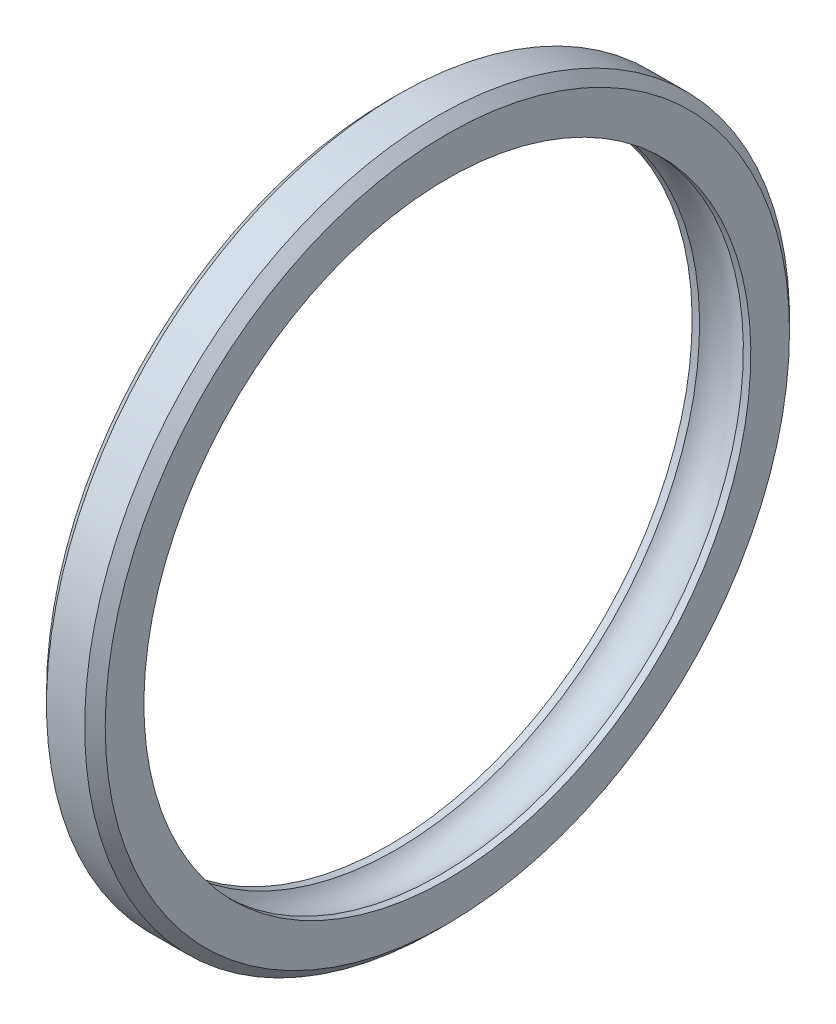
ISO-10303-21;
HEADER;
FILE_DESCRIPTION(('STEP AP214'),'2;1');
FILE_NAME('part.step','',(''),(''),'','','');
FILE_SCHEMA(('AUTOMOTIVE_DESIGN { 1 0 10303 214 1 1 1 1 }'));
ENDSEC;
DATA;
#1=APPLICATION_CONTEXT('core data for automotive mechanical design processes');
#2=APPLICATION_PROTOCOL_DEFINITION('international standard','automotive_design',2000,#1);
#3=PRODUCT_CONTEXT('',#1,'mechanical');
#4=PRODUCT('Part','Part','',(#3));
#5=PRODUCT_RELATED_PRODUCT_CATEGORY('part','',(#4));
#6=PRODUCT_DEFINITION_FORMATION('','',#4);
#7=PRODUCT_DEFINITION_CONTEXT('part definition',#1,'design');
#8=PRODUCT_DEFINITION('design','',#6,#7);
#9=PRODUCT_DEFINITION_SHAPE('','',#8);
#10=(LENGTH_UNIT() NAMED_UNIT(*) SI_UNIT(.MILLI.,.METRE.));
#11=(NAMED_UNIT(*) PLANE_ANGLE_UNIT() SI_UNIT($,.RADIAN.));
#12=(NAMED_UNIT(*) SI_UNIT($,.STERADIAN.) SOLID_ANGLE_UNIT());
#13=UNCERTAINTY_MEASURE_WITH_UNIT(LENGTH_MEASURE(1.E-05),#10,'distance_accuracy_value','');
#14=(GEOMETRIC_REPRESENTATION_CONTEXT(3) GLOBAL_UNCERTAINTY_ASSIGNED_CONTEXT((#13)) GLOBAL_UNIT_ASSIGNED_CONTEXT((#10,
#11,#12)) REPRESENTATION_CONTEXT('',''));
#15=CARTESIAN_POINT('',(0.,0.,0.));
#16=DIRECTION('',(0.,0.,1.));
#17=DIRECTION('',(1.,0.,0.));
#18=AXIS2_PLACEMENT_3D('',#15,#16,#17);
#19=CARTESIAN_POINT('',(-4.02272727272727,0.,0.));
#20=DIRECTION('',(-1.,0.,0.));
#21=DIRECTION('',(0.,-1.,0.));
#22=AXIS2_PLACEMENT_3D('',#19,#20,#21);
#23=CYLINDRICAL_SURFACE('',#22,62.);
#24=CARTESIAN_POINT('',(6.,0.,0.));
#25=DIRECTION('',(-1.,0.,0.));
#26=DIRECTION('',(0.,-1.,0.));
#27=AXIS2_PLACEMENT_3D('',#24,#25,#26);
#28=CIRCLE('',#27,62.);
#29=CARTESIAN_POINT('',(6.,-62.,0.));
#30=VERTEX_POINT('',#29);
#31=EDGE_CURVE('E10',#30,#30,#28,.T.);
#32=ORIENTED_EDGE('',*,*,#31,.F.);
#33=EDGE_LOOP('',(#32));
#34=FACE_BOUND('',#33,.T.);
#35=CARTESIAN_POINT('',(4.47213595499958,0.,0.));
#36=DIRECTION('',(-1.,0.,0.));
#37=DIRECTION('',(0.,-1.,0.));
#38=AXIS2_PLACEMENT_3D('',#35,#36,#37);
#39=CIRCLE('',#38,62.);
#40=CARTESIAN_POINT('',(4.47213595499958,-62.,0.));
#41=VERTEX_POINT('',#40);
#42=EDGE_CURVE('E22',#41,#41,#39,.T.);
#43=ORIENTED_EDGE('',*,*,#42,.T.);
#44=EDGE_LOOP('',(#43));
#45=FACE_BOUND('',#44,.T.);
#46=ADVANCED_FACE('F15',(#34,#45),#23,.F.);
#47=CARTESIAN_POINT('',(6.,0.,72.));
#48=DIRECTION('',(-1.,0.,0.));
#49=DIRECTION('',(0.,-1.,0.));
#50=AXIS2_PLACEMENT_3D('',#47,#48,#49);
#51=PLANE('',#50);
#52=CARTESIAN_POINT('',(6.,0.,0.));
#53=DIRECTION('',(-1.,0.,0.));
#54=DIRECTION('',(0.,-1.,0.));
#55=AXIS2_PLACEMENT_3D('',#52,#53,#54);
#56=CIRCLE('',#55,69.9);
#57=CARTESIAN_POINT('',(6.,-69.9,0.));
#58=VERTEX_POINT('',#57);
#59=EDGE_CURVE('E29',#58,#58,#56,.F.);
#60=ORIENTED_EDGE('',*,*,#59,.T.);
#61=EDGE_LOOP('',(#60));
#62=FACE_BOUND('',#61,.T.);
#63=ORIENTED_EDGE('',*,*,#31,.T.);
#64=EDGE_LOOP('',(#63));
#65=FACE_BOUND('',#64,.T.);
#66=ADVANCED_FACE('F77',(#62,#65),#51,.F.);
#67=CARTESIAN_POINT('',(-4.02272727272727,0.,0.));
#68=DIRECTION('',(-1.,0.,0.));
#69=DIRECTION('',(0.,-1.,0.));
#70=AXIS2_PLACEMENT_3D('',#67,#68,#69);
#71=CYLINDRICAL_SURFACE('',#70,72.);
#72=CARTESIAN_POINT('',(3.9,0.,0.));
#73=DIRECTION('',(-1.,0.,0.));
#74=DIRECTION('',(0.,-1.,0.));
#75=AXIS2_PLACEMENT_3D('',#72,#73,#74);
#76=CIRCLE('',#75,72.);
#77=CARTESIAN_POINT('',(3.9,-72.,0.));
#78=VERTEX_POINT('',#77);
#79=EDGE_CURVE('E35',#78,#78,#76,.T.);
#80=ORIENTED_EDGE('',*,*,#79,.T.);
#81=EDGE_LOOP('',(#80));
#82=FACE_BOUND('',#81,.T.);
#83=CARTESIAN_POINT('',(-3.89999999999995,0.,0.));
#84=DIRECTION('',(1.,0.,0.));
#85=DIRECTION('',(0.,1.,0.));
#86=AXIS2_PLACEMENT_3D('',#83,#84,#85);
#87=CIRCLE('',#86,72.);
#88=CARTESIAN_POINT('',(-3.89999999999995,72.,0.));
#89=VERTEX_POINT('',#88);
#90=EDGE_CURVE('E41',#89,#89,#87,.T.);
#91=ORIENTED_EDGE('',*,*,#90,.T.);
#92=EDGE_LOOP('',(#91));
#93=FACE_BOUND('',#92,.T.);
#94=ADVANCED_FACE('F70',(#82,#93),#71,.T.);
#95=CARTESIAN_POINT('',(-6.,0.,72.));
#96=DIRECTION('',(1.,0.,0.));
#97=DIRECTION('',(0.,1.,0.));
#98=AXIS2_PLACEMENT_3D('',#95,#96,#97);
#99=PLANE('',#98);
#100=CARTESIAN_POINT('',(-6.,0.,0.));
#101=DIRECTION('',(1.,0.,0.));
#102=DIRECTION('',(0.,1.,0.));
#103=AXIS2_PLACEMENT_3D('',#100,#101,#102);
#104=CIRCLE('',#103,69.9);
#105=CARTESIAN_POINT('',(-6.,69.9,0.));
#106=VERTEX_POINT('',#105);
#107=EDGE_CURVE('E45',#106,#106,#104,.F.);
#108=ORIENTED_EDGE('',*,*,#107,.T.);
#109=EDGE_LOOP('',(#108));
#110=FACE_BOUND('',#109,.T.);
#111=CARTESIAN_POINT('',(-6.,0.,0.));
#112=DIRECTION('',(-1.,0.,0.));
#113=DIRECTION('',(0.,-1.,0.));
#114=AXIS2_PLACEMENT_3D('',#111,#112,#113);
#115=CIRCLE('',#114,62.);
#116=CARTESIAN_POINT('',(-6.,-62.,0.));
#117=VERTEX_POINT('',#116);
#118=EDGE_CURVE('E49',#117,#117,#115,.T.);
#119=ORIENTED_EDGE('',*,*,#118,.F.);
#120=EDGE_LOOP('',(#119));
#121=FACE_BOUND('',#120,.T.);
#122=ADVANCED_FACE('F65',(#110,#121),#99,.F.);
#123=CARTESIAN_POINT('',(-4.02272727272727,0.,0.));
#124=DIRECTION('',(-1.,0.,0.));
#125=DIRECTION('',(0.,-1.,0.));
#126=AXIS2_PLACEMENT_3D('',#123,#124,#125);
#127=CYLINDRICAL_SURFACE('',#126,62.);
#128=CARTESIAN_POINT('',(-4.47213595499958,0.,0.));
#129=DIRECTION('',(-1.,0.,0.));
#130=DIRECTION('',(0.,-1.,0.));
#131=AXIS2_PLACEMENT_3D('',#128,#129,#130);
#132=CIRCLE('',#131,62.);
#133=CARTESIAN_POINT('',(-4.47213595499958,-62.,0.));
#134=VERTEX_POINT('',#133);
#135=EDGE_CURVE('E53',#134,#134,#132,.T.);
#136=ORIENTED_EDGE('',*,*,#135,.F.);
#137=EDGE_LOOP('',(#136));
#138=FACE_BOUND('',#137,.T.);
#139=ORIENTED_EDGE('',*,*,#118,.T.);
#140=EDGE_LOOP('',(#139));
#141=FACE_BOUND('',#140,.T.);
#142=ADVANCED_FACE('F62',(#138,#141),#127,.F.);
#143=CARTESIAN_POINT('',(0.,0.,0.));
#144=DIRECTION('',(-1.,0.,0.));
#145=DIRECTION('',(0.,-1.,0.));
#146=AXIS2_PLACEMENT_3D('',#143,#144,#145);
#147=TOROIDAL_SURFACE('',#146,58.,6.);
#148=ORIENTED_EDGE('',*,*,#42,.F.);
#149=EDGE_LOOP('',(#148));
#150=FACE_BOUND('',#149,.T.);
#151=ORIENTED_EDGE('',*,*,#135,.T.);
#152=EDGE_LOOP('',(#151));
#153=FACE_BOUND('',#152,.T.);
#154=ADVANCED_FACE('F60',(#150,#153),#147,.F.);
#155=CARTESIAN_POINT('',(3.9,0.,0.));
#156=DIRECTION('',(-1.,0.,0.));
#157=DIRECTION('',(0.,-1.,0.));
#158=AXIS2_PLACEMENT_3D('',#155,#156,#157);
#159=CONICAL_SURFACE('',#158,72.,0.785398163397445);
#160=ORIENTED_EDGE('',*,*,#59,.F.);
#161=EDGE_LOOP('',(#160));
#162=FACE_BOUND('',#161,.T.);
#163=ORIENTED_EDGE('',*,*,#79,.F.);
#164=EDGE_LOOP('',(#163));
#165=FACE_BOUND('',#164,.T.);
#166=ADVANCED_FACE('F90',(#162,#165),#159,.T.);
#167=CARTESIAN_POINT('',(-6.,0.,0.));
#168=DIRECTION('',(1.,0.,0.));
#169=DIRECTION('',(0.,1.,0.));
#170=AXIS2_PLACEMENT_3D('',#167,#168,#169);
#171=CONICAL_SURFACE('',#170,69.9,0.785398163397445);
#172=ORIENTED_EDGE('',*,*,#90,.F.);
#173=EDGE_LOOP('',(#172));
#174=FACE_BOUND('',#173,.T.);
#175=ORIENTED_EDGE('',*,*,#107,.F.);
#176=EDGE_LOOP('',(#175));
#177=FACE_BOUND('',#176,.T.);
#178=ADVANCED_FACE('F93',(#174,#177),#171,.T.);
#179=CLOSED_SHELL('',(#46,#66,#94,#122,#142,#154,#166,#178));
#180=MANIFOLD_SOLID_BREP('B1',#179);
#181=ADVANCED_BREP_SHAPE_REPRESENTATION('',(#18,#180),#14);
#182=SHAPE_DEFINITION_REPRESENTATION(#9,#181);
ENDSEC;
END-ISO-10303-21;
